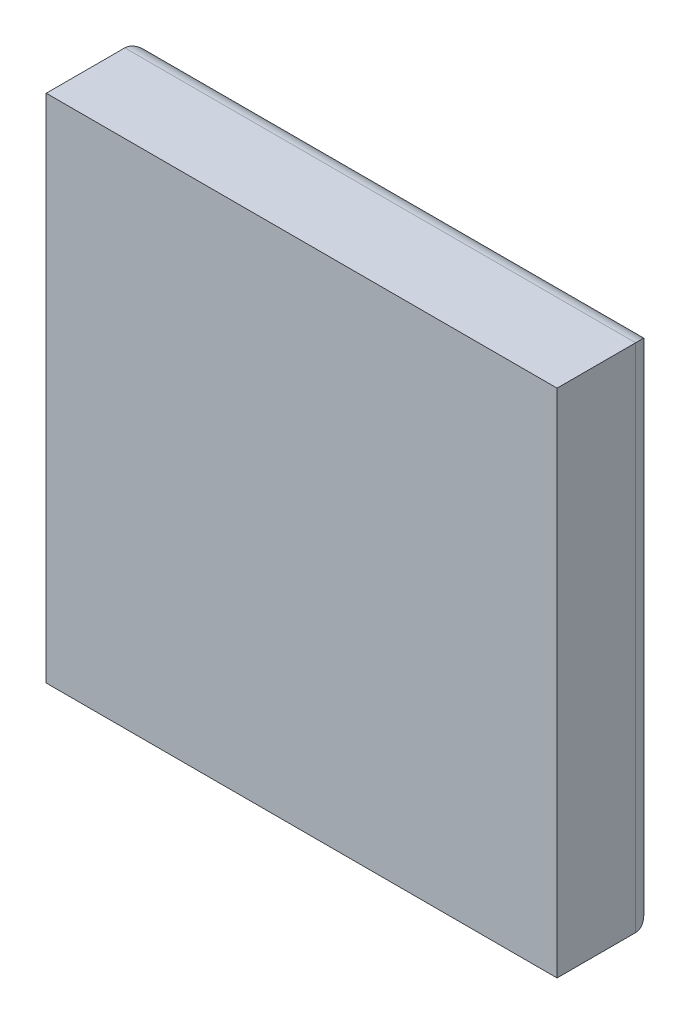
ISO-10303-21;
HEADER;
FILE_DESCRIPTION(('STEP AP214'),'2;1');
FILE_NAME('part.step','',(''),(''),'','','');
FILE_SCHEMA(('AUTOMOTIVE_DESIGN { 1 0 10303 214 1 1 1 1 }'));
ENDSEC;
DATA;
#1=APPLICATION_CONTEXT('core data for automotive mechanical design processes');
#2=APPLICATION_PROTOCOL_DEFINITION('international standard','automotive_design',2000,#1);
#3=PRODUCT_CONTEXT('',#1,'mechanical');
#4=PRODUCT('Part','Part','',(#3));
#5=PRODUCT_RELATED_PRODUCT_CATEGORY('part','',(#4));
#6=PRODUCT_DEFINITION_FORMATION('','',#4);
#7=PRODUCT_DEFINITION_CONTEXT('part definition',#1,'design');
#8=PRODUCT_DEFINITION('design','',#6,#7);
#9=PRODUCT_DEFINITION_SHAPE('','',#8);
#10=(LENGTH_UNIT() NAMED_UNIT(*) SI_UNIT(.MILLI.,.METRE.));
#11=(NAMED_UNIT(*) PLANE_ANGLE_UNIT() SI_UNIT($,.RADIAN.));
#12=(NAMED_UNIT(*) SI_UNIT($,.STERADIAN.) SOLID_ANGLE_UNIT());
#13=UNCERTAINTY_MEASURE_WITH_UNIT(LENGTH_MEASURE(1.E-05),#10,'distance_accuracy_value','');
#14=(GEOMETRIC_REPRESENTATION_CONTEXT(3) GLOBAL_UNCERTAINTY_ASSIGNED_CONTEXT((#13)) GLOBAL_UNIT_ASSIGNED_CONTEXT((#10,
#11,#12)) REPRESENTATION_CONTEXT('',''));
#15=CARTESIAN_POINT('',(0.,0.,0.));
#16=DIRECTION('',(0.,0.,1.));
#17=DIRECTION('',(1.,0.,0.));
#18=AXIS2_PLACEMENT_3D('',#15,#16,#17);
#19=CARTESIAN_POINT('',(-36.8398172028909,-1.13693244739757,5.));
#20=DIRECTION('',(1.,0.,0.));
#21=DIRECTION('',(0.,1.,0.));
#22=AXIS2_PLACEMENT_3D('',#19,#20,#21);
#23=PLANE('',#22);
#24=DIRECTION('',(0.,0.,-1.));
#25=VECTOR('',#24,1.);
#26=CARTESIAN_POINT('',(-36.8398172028909,-1.13693244739757,5.));
#27=LINE('',#26,#25);
#28=CARTESIAN_POINT('',(-36.8398172028909,-1.13693244739757,5.));
#29=VERTEX_POINT('',#28);
#30=CARTESIAN_POINT('',(-36.8398172028909,-1.13693244739757,1.));
#31=VERTEX_POINT('',#30);
#32=EDGE_CURVE('E154',#29,#31,#27,.T.);
#33=ORIENTED_EDGE('',*,*,#32,.T.);
#34=DIRECTION('',(0.,-1.,0.));
#35=VECTOR('',#34,1.);
#36=CARTESIAN_POINT('',(-36.8398172028909,-1.13693244739757,1.));
#37=LINE('',#36,#35);
#38=CARTESIAN_POINT('',(-36.8398172028909,-27.1369324473976,1.));
#39=VERTEX_POINT('',#38);
#40=EDGE_CURVE('E11',#31,#39,#37,.T.);
#41=ORIENTED_EDGE('',*,*,#40,.T.);
#42=DIRECTION('',(0.,0.,-1.));
#43=VECTOR('',#42,1.);
#44=CARTESIAN_POINT('',(-36.8398172028909,-27.1369324473976,5.));
#45=LINE('',#44,#43);
#46=CARTESIAN_POINT('',(-36.8398172028909,-27.1369324473976,5.));
#47=VERTEX_POINT('',#46);
#48=EDGE_CURVE('E96',#47,#39,#45,.T.);
#49=ORIENTED_EDGE('',*,*,#48,.F.);
#50=DIRECTION('',(0.,-1.,0.));
#51=VECTOR('',#50,1.);
#52=CARTESIAN_POINT('',(-36.8398172028909,-1.13693244739757,5.));
#53=LINE('',#52,#51);
#54=EDGE_CURVE('E102',#29,#47,#53,.T.);
#55=ORIENTED_EDGE('',*,*,#54,.F.);
#56=EDGE_LOOP('',(#33,#41,#49,#55));
#57=FACE_BOUND('',#56,.T.);
#58=ADVANCED_FACE('F35',(#57),#23,.F.);
#59=CARTESIAN_POINT('',(-36.8398172028909,-27.1369324473976,5.));
#60=DIRECTION('',(0.,1.,0.));
#61=DIRECTION('',(0.,0.,1.));
#62=AXIS2_PLACEMENT_3D('',#59,#60,#61);
#63=PLANE('',#62);
#64=ORIENTED_EDGE('',*,*,#48,.T.);
#65=DIRECTION('',(1.,0.,0.));
#66=VECTOR('',#65,1.);
#67=CARTESIAN_POINT('',(-36.8398172028909,-27.1369324473976,1.));
#68=LINE('',#67,#66);
#69=CARTESIAN_POINT('',(-10.8398172028909,-27.1369324473976,1.));
#70=VERTEX_POINT('',#69);
#71=EDGE_CURVE('E111',#39,#70,#68,.T.);
#72=ORIENTED_EDGE('',*,*,#71,.T.);
#73=DIRECTION('',(0.,0.,-1.));
#74=VECTOR('',#73,1.);
#75=CARTESIAN_POINT('',(-10.8398172028909,-27.1369324473976,5.));
#76=LINE('',#75,#74);
#77=CARTESIAN_POINT('',(-10.8398172028909,-27.1369324473976,5.));
#78=VERTEX_POINT('',#77);
#79=EDGE_CURVE('E98',#78,#70,#76,.T.);
#80=ORIENTED_EDGE('',*,*,#79,.F.);
#81=DIRECTION('',(1.,0.,0.));
#82=VECTOR('',#81,1.);
#83=CARTESIAN_POINT('',(-36.8398172028909,-27.1369324473976,5.));
#84=LINE('',#83,#82);
#85=EDGE_CURVE('E91',#47,#78,#84,.T.);
#86=ORIENTED_EDGE('',*,*,#85,.F.);
#87=EDGE_LOOP('',(#64,#72,#80,#86));
#88=FACE_BOUND('',#87,.T.);
#89=ADVANCED_FACE('F93',(#88),#63,.F.);
#90=CARTESIAN_POINT('',(-10.8398172028909,-1.13693244739757,5.));
#91=DIRECTION('',(-1.,0.,0.));
#92=DIRECTION('',(0.,-1.,0.));
#93=AXIS2_PLACEMENT_3D('',#90,#91,#92);
#94=PLANE('',#93);
#95=ORIENTED_EDGE('',*,*,#79,.T.);
#96=DIRECTION('',(0.,1.,0.));
#97=VECTOR('',#96,1.);
#98=CARTESIAN_POINT('',(-10.8398172028909,-1.13693244739757,1.));
#99=LINE('',#98,#97);
#100=CARTESIAN_POINT('',(-10.8398172028909,-1.13693244739757,1.));
#101=VERTEX_POINT('',#100);
#102=EDGE_CURVE('E44',#70,#101,#99,.T.);
#103=ORIENTED_EDGE('',*,*,#102,.T.);
#104=DIRECTION('',(0.,0.,-1.));
#105=VECTOR('',#104,1.);
#106=CARTESIAN_POINT('',(-10.8398172028909,-1.13693244739757,5.));
#107=LINE('',#106,#105);
#108=CARTESIAN_POINT('',(-10.8398172028909,-1.13693244739757,5.));
#109=VERTEX_POINT('',#108);
#110=EDGE_CURVE('E115',#109,#101,#107,.T.);
#111=ORIENTED_EDGE('',*,*,#110,.F.);
#112=DIRECTION('',(0.,1.,0.));
#113=VECTOR('',#112,1.);
#114=CARTESIAN_POINT('',(-10.8398172028909,-1.13693244739757,5.));
#115=LINE('',#114,#113);
#116=EDGE_CURVE('E101',#78,#109,#115,.T.);
#117=ORIENTED_EDGE('',*,*,#116,.F.);
#118=EDGE_LOOP('',(#95,#103,#111,#117));
#119=FACE_BOUND('',#118,.T.);
#120=ADVANCED_FACE('F152',(#119),#94,.F.);
#121=CARTESIAN_POINT('',(-36.8398172028909,-1.13693244739757,5.));
#122=DIRECTION('',(0.,-1.,0.));
#123=DIRECTION('',(0.,0.,-1.));
#124=AXIS2_PLACEMENT_3D('',#121,#122,#123);
#125=PLANE('',#124);
#126=ORIENTED_EDGE('',*,*,#110,.T.);
#127=DIRECTION('',(-1.,0.,0.));
#128=VECTOR('',#127,1.);
#129=CARTESIAN_POINT('',(-36.8398172028909,-1.13693244739757,1.));
#130=LINE('',#129,#128);
#131=EDGE_CURVE('E58',#101,#31,#130,.T.);
#132=ORIENTED_EDGE('',*,*,#131,.T.);
#133=ORIENTED_EDGE('',*,*,#32,.F.);
#134=DIRECTION('',(-1.,0.,0.));
#135=VECTOR('',#134,1.);
#136=CARTESIAN_POINT('',(-36.8398172028909,-1.13693244739757,5.));
#137=LINE('',#136,#135);
#138=EDGE_CURVE('E107',#109,#29,#137,.T.);
#139=ORIENTED_EDGE('',*,*,#138,.F.);
#140=EDGE_LOOP('',(#126,#132,#133,#139));
#141=FACE_BOUND('',#140,.T.);
#142=ADVANCED_FACE('F157',(#141),#125,.F.);
#143=CARTESIAN_POINT('',(0.,0.,5.));
#144=DIRECTION('',(0.,0.,1.));
#145=DIRECTION('',(1.,0.,0.));
#146=AXIS2_PLACEMENT_3D('',#143,#144,#145);
#147=PLANE('',#146);
#148=ORIENTED_EDGE('',*,*,#54,.T.);
#149=ORIENTED_EDGE('',*,*,#85,.T.);
#150=ORIENTED_EDGE('',*,*,#116,.T.);
#151=ORIENTED_EDGE('',*,*,#138,.T.);
#152=EDGE_LOOP('',(#148,#149,#150,#151));
#153=FACE_BOUND('',#152,.T.);
#154=ADVANCED_FACE('F105',(#153),#147,.T.);
#155=CARTESIAN_POINT('',(0.,0.,0.));
#156=DIRECTION('',(0.,0.,1.));
#157=DIRECTION('',(1.,0.,0.));
#158=AXIS2_PLACEMENT_3D('',#155,#156,#157);
#159=PLANE('',#158);
#160=DIRECTION('',(-1.,0.,0.));
#161=VECTOR('',#160,1.);
#162=CARTESIAN_POINT('',(0.,-2.13693244739757,0.));
#163=LINE('',#162,#161);
#164=CARTESIAN_POINT('',(-35.8398172028909,-2.13693244739757,0.));
#165=VERTEX_POINT('',#164);
#166=CARTESIAN_POINT('',(-11.8398172028909,-2.13693244739757,0.));
#167=VERTEX_POINT('',#166);
#168=EDGE_CURVE('E120',#165,#167,#163,.F.);
#169=ORIENTED_EDGE('',*,*,#168,.T.);
#170=DIRECTION('',(0.,1.,0.));
#171=VECTOR('',#170,1.);
#172=CARTESIAN_POINT('',(-11.8398172028909,0.,0.));
#173=LINE('',#172,#171);
#174=CARTESIAN_POINT('',(-11.8398172028909,-26.1369324473976,0.));
#175=VERTEX_POINT('',#174);
#176=EDGE_CURVE('E125',#167,#175,#173,.F.);
#177=ORIENTED_EDGE('',*,*,#176,.T.);
#178=DIRECTION('',(1.,0.,0.));
#179=VECTOR('',#178,1.);
#180=CARTESIAN_POINT('',(0.,-26.1369324473976,0.));
#181=LINE('',#180,#179);
#182=CARTESIAN_POINT('',(-35.8398172028909,-26.1369324473976,0.));
#183=VERTEX_POINT('',#182);
#184=EDGE_CURVE('E122',#175,#183,#181,.F.);
#185=ORIENTED_EDGE('',*,*,#184,.T.);
#186=DIRECTION('',(0.,-1.,0.));
#187=VECTOR('',#186,1.);
#188=CARTESIAN_POINT('',(-35.8398172028909,0.,0.));
#189=LINE('',#188,#187);
#190=EDGE_CURVE('E113',#183,#165,#189,.F.);
#191=ORIENTED_EDGE('',*,*,#190,.T.);
#192=EDGE_LOOP('',(#169,#177,#185,#191));
#193=FACE_BOUND('',#192,.T.);
#194=ADVANCED_FACE('F145',(#193),#159,.F.);
#195=CARTESIAN_POINT('',(-36.8398172028909,-2.13693244739757,1.));
#196=DIRECTION('',(-1.,0.,0.));
#197=DIRECTION('',(0.,0.,1.));
#198=AXIS2_PLACEMENT_3D('',#195,#196,#197);
#199=CYLINDRICAL_SURFACE('',#198,1.);
#200=CARTESIAN_POINT('',(-11.8398172028909,-2.13693244739757,1.));
#201=DIRECTION('',(-0.707106781186548,0.707106781186547,0.));
#202=DIRECTION('',(0.707106781186547,0.707106781186548,0.));
#203=AXIS2_PLACEMENT_3D('',#200,#201,#202);
#204=ELLIPSE('',#203,1.41421356237309,1.);
#205=EDGE_CURVE('E132',#167,#101,#204,.F.);
#206=ORIENTED_EDGE('',*,*,#205,.F.);
#207=ORIENTED_EDGE('',*,*,#168,.F.);
#208=CARTESIAN_POINT('',(-35.8398172028909,-2.13693244739757,1.));
#209=DIRECTION('',(-0.707106781186548,-0.707106781186547,0.));
#210=DIRECTION('',(0.707106781186547,-0.707106781186548,0.));
#211=AXIS2_PLACEMENT_3D('',#208,#209,#210);
#212=ELLIPSE('',#211,1.41421356237309,1.);
#213=EDGE_CURVE('E39',#31,#165,#212,.T.);
#214=ORIENTED_EDGE('',*,*,#213,.F.);
#215=ORIENTED_EDGE('',*,*,#131,.F.);
#216=EDGE_LOOP('',(#206,#207,#214,#215));
#217=FACE_BOUND('',#216,.T.);
#218=ADVANCED_FACE('F37',(#217),#199,.T.);
#219=CARTESIAN_POINT('',(-35.8398172028909,-1.13693244739757,1.));
#220=DIRECTION('',(0.,-1.,0.));
#221=DIRECTION('',(1.,0.,0.));
#222=AXIS2_PLACEMENT_3D('',#219,#220,#221);
#223=CYLINDRICAL_SURFACE('',#222,1.);
#224=ORIENTED_EDGE('',*,*,#213,.T.);
#225=ORIENTED_EDGE('',*,*,#190,.F.);
#226=CARTESIAN_POINT('',(-35.8398172028909,-26.1369324473976,1.));
#227=DIRECTION('',(0.707106781186547,-0.707106781186548,0.));
#228=DIRECTION('',(-0.707106781186548,-0.707106781186547,0.));
#229=AXIS2_PLACEMENT_3D('',#226,#227,#228);
#230=ELLIPSE('',#229,1.4142135623731,1.);
#231=EDGE_CURVE('E131',#39,#183,#230,.T.);
#232=ORIENTED_EDGE('',*,*,#231,.F.);
#233=ORIENTED_EDGE('',*,*,#40,.F.);
#234=EDGE_LOOP('',(#224,#225,#232,#233));
#235=FACE_BOUND('',#234,.T.);
#236=ADVANCED_FACE('F141',(#235),#223,.T.);
#237=CARTESIAN_POINT('',(-11.8398172028909,-1.13693244739757,1.));
#238=DIRECTION('',(0.,1.,0.));
#239=DIRECTION('',(-1.,0.,0.));
#240=AXIS2_PLACEMENT_3D('',#237,#238,#239);
#241=CYLINDRICAL_SURFACE('',#240,1.);
#242=ORIENTED_EDGE('',*,*,#205,.T.);
#243=ORIENTED_EDGE('',*,*,#102,.F.);
#244=CARTESIAN_POINT('',(-11.8398172028909,-26.1369324473976,1.));
#245=DIRECTION('',(0.707106781186547,0.707106781186548,0.));
#246=DIRECTION('',(-0.707106781186548,0.707106781186547,0.));
#247=AXIS2_PLACEMENT_3D('',#244,#245,#246);
#248=ELLIPSE('',#247,1.4142135623731,1.);
#249=EDGE_CURVE('E129',#175,#70,#248,.F.);
#250=ORIENTED_EDGE('',*,*,#249,.F.);
#251=ORIENTED_EDGE('',*,*,#176,.F.);
#252=EDGE_LOOP('',(#242,#243,#250,#251));
#253=FACE_BOUND('',#252,.T.);
#254=ADVANCED_FACE('F151',(#253),#241,.T.);
#255=CARTESIAN_POINT('',(-36.8398172028909,-26.1369324473976,1.));
#256=DIRECTION('',(1.,0.,0.));
#257=DIRECTION('',(0.,0.,-1.));
#258=AXIS2_PLACEMENT_3D('',#255,#256,#257);
#259=CYLINDRICAL_SURFACE('',#258,1.);
#260=ORIENTED_EDGE('',*,*,#231,.T.);
#261=ORIENTED_EDGE('',*,*,#184,.F.);
#262=ORIENTED_EDGE('',*,*,#249,.T.);
#263=ORIENTED_EDGE('',*,*,#71,.F.);
#264=EDGE_LOOP('',(#260,#261,#262,#263));
#265=FACE_BOUND('',#264,.T.);
#266=ADVANCED_FACE('F149',(#265),#259,.T.);
#267=CLOSED_SHELL('',(#58,#89,#120,#142,#154,#194,#218,#236,#254,#266));
#268=MANIFOLD_SOLID_BREP('B2',#267);
#269=ADVANCED_BREP_SHAPE_REPRESENTATION('',(#18,#268),#14);
#270=SHAPE_DEFINITION_REPRESENTATION(#9,#269);
ENDSEC;
END-ISO-10303-21;
